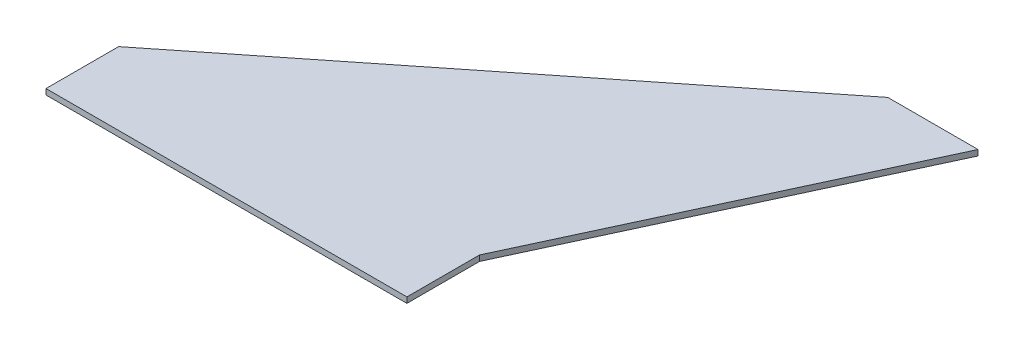
ISO-10303-21;
HEADER;
FILE_DESCRIPTION(('STEP AP214'),'2;1');
FILE_NAME('part.step','',(''),(''),'','','');
FILE_SCHEMA(('AUTOMOTIVE_DESIGN { 1 0 10303 214 1 1 1 1 }'));
ENDSEC;
DATA;
#1=APPLICATION_CONTEXT('core data for automotive mechanical design processes');
#2=APPLICATION_PROTOCOL_DEFINITION('international standard','automotive_design',2000,#1);
#3=PRODUCT_CONTEXT('',#1,'mechanical');
#4=PRODUCT('Part','Part','',(#3));
#5=PRODUCT_RELATED_PRODUCT_CATEGORY('part','',(#4));
#6=PRODUCT_DEFINITION_FORMATION('','',#4);
#7=PRODUCT_DEFINITION_CONTEXT('part definition',#1,'design');
#8=PRODUCT_DEFINITION('design','',#6,#7);
#9=PRODUCT_DEFINITION_SHAPE('','',#8);
#10=(LENGTH_UNIT() NAMED_UNIT(*) SI_UNIT(.MILLI.,.METRE.));
#11=(NAMED_UNIT(*) PLANE_ANGLE_UNIT() SI_UNIT($,.RADIAN.));
#12=(NAMED_UNIT(*) SI_UNIT($,.STERADIAN.) SOLID_ANGLE_UNIT());
#13=UNCERTAINTY_MEASURE_WITH_UNIT(LENGTH_MEASURE(1.E-05),#10,'distance_accuracy_value','');
#14=(GEOMETRIC_REPRESENTATION_CONTEXT(3) GLOBAL_UNCERTAINTY_ASSIGNED_CONTEXT((#13)) GLOBAL_UNIT_ASSIGNED_CONTEXT((#10,
#11,#12)) REPRESENTATION_CONTEXT('',''));
#15=CARTESIAN_POINT('',(0.,0.,0.));
#16=DIRECTION('',(0.,0.,1.));
#17=DIRECTION('',(1.,0.,0.));
#18=AXIS2_PLACEMENT_3D('',#15,#16,#17);
#19=CARTESIAN_POINT('',(203.2,3.175,0.));
#20=DIRECTION('',(-1.,0.,0.));
#21=DIRECTION('',(0.,0.,1.));
#22=AXIS2_PLACEMENT_3D('',#19,#20,#21);
#23=PLANE('',#22);
#24=DIRECTION('',(0.,0.,-1.));
#25=VECTOR('',#24,1.);
#26=CARTESIAN_POINT('',(203.2,0.,0.));
#27=LINE('',#26,#25);
#28=CARTESIAN_POINT('',(203.2,0.,0.));
#29=VERTEX_POINT('',#28);
#30=CARTESIAN_POINT('',(203.2,0.,-40.894));
#31=VERTEX_POINT('',#30);
#32=EDGE_CURVE('E120',#29,#31,#27,.T.);
#33=ORIENTED_EDGE('',*,*,#32,.T.);
#34=DIRECTION('',(0.,-1.,0.));
#35=VECTOR('',#34,1.);
#36=CARTESIAN_POINT('',(203.2,3.175,-40.894));
#37=LINE('',#36,#35);
#38=CARTESIAN_POINT('',(203.2,3.175,-40.894));
#39=VERTEX_POINT('',#38);
#40=EDGE_CURVE('E11',#39,#31,#37,.T.);
#41=ORIENTED_EDGE('',*,*,#40,.F.);
#42=DIRECTION('',(0.,0.,-1.));
#43=VECTOR('',#42,1.);
#44=CARTESIAN_POINT('',(203.2,3.175,0.));
#45=LINE('',#44,#43);
#46=CARTESIAN_POINT('',(203.2,3.175,0.));
#47=VERTEX_POINT('',#46);
#48=EDGE_CURVE('E85',#47,#39,#45,.T.);
#49=ORIENTED_EDGE('',*,*,#48,.F.);
#50=DIRECTION('',(0.,-1.,0.));
#51=VECTOR('',#50,1.);
#52=CARTESIAN_POINT('',(203.2,3.175,0.));
#53=LINE('',#52,#51);
#54=EDGE_CURVE('E116',#47,#29,#53,.T.);
#55=ORIENTED_EDGE('',*,*,#54,.T.);
#56=EDGE_LOOP('',(#33,#41,#49,#55));
#57=FACE_BOUND('',#56,.T.);
#58=ADVANCED_FACE('F39',(#57),#23,.F.);
#59=CARTESIAN_POINT('',(151.652056604455,3.175,70.3022778961048));
#60=DIRECTION('',(0.907254693579712,0.,0.42058164603033));
#61=DIRECTION('',(0.42058164603033,0.,-0.907254693579713));
#62=AXIS2_PLACEMENT_3D('',#59,#60,#61);
#63=PLANE('',#62);
#64=DIRECTION('',(-0.42058164603033,0.,0.907254693579713));
#65=VECTOR('',#64,1.);
#66=CARTESIAN_POINT('',(151.652056604455,0.,70.3022778961048));
#67=LINE('',#66,#65);
#68=CARTESIAN_POINT('',(292.1,0.,-232.664));
#69=VERTEX_POINT('',#68);
#70=EDGE_CURVE('E123',#69,#31,#67,.T.);
#71=ORIENTED_EDGE('',*,*,#70,.F.);
#72=DIRECTION('',(0.,-1.,0.));
#73=VECTOR('',#72,1.);
#74=CARTESIAN_POINT('',(292.1,3.175,-232.664));
#75=LINE('',#74,#73);
#76=CARTESIAN_POINT('',(292.1,3.175,-232.664));
#77=VERTEX_POINT('',#76);
#78=EDGE_CURVE('E47',#77,#69,#75,.T.);
#79=ORIENTED_EDGE('',*,*,#78,.F.);
#80=DIRECTION('',(-0.42058164603033,0.,0.907254693579713));
#81=VECTOR('',#80,1.);
#82=CARTESIAN_POINT('',(151.652056604455,3.175,70.3022778961048));
#83=LINE('',#82,#81);
#84=EDGE_CURVE('E145',#77,#39,#83,.T.);
#85=ORIENTED_EDGE('',*,*,#84,.T.);
#86=ORIENTED_EDGE('',*,*,#40,.T.);
#87=EDGE_LOOP('',(#71,#79,#85,#86));
#88=FACE_BOUND('',#87,.T.);
#89=ADVANCED_FACE('F144',(#88),#63,.T.);
#90=CARTESIAN_POINT('',(0.,3.175,-232.664));
#91=DIRECTION('',(0.,0.,1.));
#92=DIRECTION('',(1.,0.,0.));
#93=AXIS2_PLACEMENT_3D('',#90,#91,#92);
#94=PLANE('',#93);
#95=DIRECTION('',(-1.,0.,0.));
#96=VECTOR('',#95,1.);
#97=CARTESIAN_POINT('',(0.,0.,-232.664));
#98=LINE('',#97,#96);
#99=CARTESIAN_POINT('',(241.3,0.,-232.664));
#100=VERTEX_POINT('',#99);
#101=EDGE_CURVE('E126',#69,#100,#98,.T.);
#102=ORIENTED_EDGE('',*,*,#101,.T.);
#103=DIRECTION('',(0.,-1.,0.));
#104=VECTOR('',#103,1.);
#105=CARTESIAN_POINT('',(241.3,3.175,-232.664));
#106=LINE('',#105,#104);
#107=CARTESIAN_POINT('',(241.3,3.175,-232.664));
#108=VERTEX_POINT('',#107);
#109=EDGE_CURVE('E106',#108,#100,#106,.T.);
#110=ORIENTED_EDGE('',*,*,#109,.F.);
#111=DIRECTION('',(-1.,0.,0.));
#112=VECTOR('',#111,1.);
#113=CARTESIAN_POINT('',(0.,3.175,-232.664));
#114=LINE('',#113,#112);
#115=EDGE_CURVE('E111',#77,#108,#114,.T.);
#116=ORIENTED_EDGE('',*,*,#115,.F.);
#117=ORIENTED_EDGE('',*,*,#78,.T.);
#118=EDGE_LOOP('',(#102,#110,#116,#117));
#119=FACE_BOUND('',#118,.T.);
#120=ADVANCED_FACE('F137',(#119),#94,.F.);
#121=CARTESIAN_POINT('',(-19.9189973005552,3.175,-25.0636389874535));
#122=DIRECTION('',(-0.62217937915375,0.,-0.782874715491473));
#123=DIRECTION('',(-0.782874715491473,0.,0.62217937915375));
#124=AXIS2_PLACEMENT_3D('',#121,#122,#123);
#125=PLANE('',#124);
#126=DIRECTION('',(0.782874715491473,0.,-0.62217937915375));
#127=VECTOR('',#126,1.);
#128=CARTESIAN_POINT('',(-19.9189973005552,0.,-25.0636389874535));
#129=LINE('',#128,#127);
#130=CARTESIAN_POINT('',(0.,0.,-40.894));
#131=VERTEX_POINT('',#130);
#132=EDGE_CURVE('E101',#131,#100,#129,.T.);
#133=ORIENTED_EDGE('',*,*,#132,.F.);
#134=DIRECTION('',(0.,-1.,0.));
#135=VECTOR('',#134,1.);
#136=CARTESIAN_POINT('',(0.,3.175,-40.894));
#137=LINE('',#136,#135);
#138=CARTESIAN_POINT('',(0.,3.175,-40.894));
#139=VERTEX_POINT('',#138);
#140=EDGE_CURVE('E96',#139,#131,#137,.T.);
#141=ORIENTED_EDGE('',*,*,#140,.F.);
#142=DIRECTION('',(0.782874715491473,0.,-0.62217937915375));
#143=VECTOR('',#142,1.);
#144=CARTESIAN_POINT('',(-19.9189973005552,3.175,-25.0636389874535));
#145=LINE('',#144,#143);
#146=EDGE_CURVE('E99',#139,#108,#145,.T.);
#147=ORIENTED_EDGE('',*,*,#146,.T.);
#148=ORIENTED_EDGE('',*,*,#109,.T.);
#149=EDGE_LOOP('',(#133,#141,#147,#148));
#150=FACE_BOUND('',#149,.T.);
#151=ADVANCED_FACE('F98',(#150),#125,.T.);
#152=CARTESIAN_POINT('',(0.,3.175,0.));
#153=DIRECTION('',(-1.,0.,0.));
#154=DIRECTION('',(0.,0.,1.));
#155=AXIS2_PLACEMENT_3D('',#152,#153,#154);
#156=PLANE('',#155);
#157=DIRECTION('',(0.,0.,-1.));
#158=VECTOR('',#157,1.);
#159=CARTESIAN_POINT('',(0.,0.,0.));
#160=LINE('',#159,#158);
#161=CARTESIAN_POINT('',(0.,0.,0.));
#162=VERTEX_POINT('',#161);
#163=EDGE_CURVE('E130',#162,#131,#160,.T.);
#164=ORIENTED_EDGE('',*,*,#163,.F.);
#165=DIRECTION('',(0.,-1.,0.));
#166=VECTOR('',#165,1.);
#167=CARTESIAN_POINT('',(0.,3.175,0.));
#168=LINE('',#167,#166);
#169=CARTESIAN_POINT('',(0.,3.175,0.));
#170=VERTEX_POINT('',#169);
#171=EDGE_CURVE('E76',#170,#162,#168,.T.);
#172=ORIENTED_EDGE('',*,*,#171,.F.);
#173=DIRECTION('',(0.,0.,-1.));
#174=VECTOR('',#173,1.);
#175=CARTESIAN_POINT('',(0.,3.175,0.));
#176=LINE('',#175,#174);
#177=EDGE_CURVE('E109',#170,#139,#176,.T.);
#178=ORIENTED_EDGE('',*,*,#177,.T.);
#179=ORIENTED_EDGE('',*,*,#140,.T.);
#180=EDGE_LOOP('',(#164,#172,#178,#179));
#181=FACE_BOUND('',#180,.T.);
#182=ADVANCED_FACE('F114',(#181),#156,.T.);
#183=CARTESIAN_POINT('',(0.,3.175,0.));
#184=DIRECTION('',(0.,0.,-1.));
#185=DIRECTION('',(-1.,0.,0.));
#186=AXIS2_PLACEMENT_3D('',#183,#184,#185);
#187=PLANE('',#186);
#188=DIRECTION('',(1.,0.,0.));
#189=VECTOR('',#188,1.);
#190=CARTESIAN_POINT('',(0.,0.,0.));
#191=LINE('',#190,#189);
#192=EDGE_CURVE('E79',#162,#29,#191,.T.);
#193=ORIENTED_EDGE('',*,*,#192,.T.);
#194=ORIENTED_EDGE('',*,*,#54,.F.);
#195=DIRECTION('',(1.,0.,0.));
#196=VECTOR('',#195,1.);
#197=CARTESIAN_POINT('',(0.,3.175,0.));
#198=LINE('',#197,#196);
#199=EDGE_CURVE('E55',#170,#47,#198,.T.);
#200=ORIENTED_EDGE('',*,*,#199,.F.);
#201=ORIENTED_EDGE('',*,*,#171,.T.);
#202=EDGE_LOOP('',(#193,#194,#200,#201));
#203=FACE_BOUND('',#202,.T.);
#204=ADVANCED_FACE('F147',(#203),#187,.F.);
#205=CARTESIAN_POINT('',(0.,3.175,0.));
#206=DIRECTION('',(0.,1.,0.));
#207=DIRECTION('',(0.,0.,1.));
#208=AXIS2_PLACEMENT_3D('',#205,#206,#207);
#209=PLANE('',#208);
#210=ORIENTED_EDGE('',*,*,#48,.T.);
#211=ORIENTED_EDGE('',*,*,#84,.F.);
#212=ORIENTED_EDGE('',*,*,#115,.T.);
#213=ORIENTED_EDGE('',*,*,#146,.F.);
#214=ORIENTED_EDGE('',*,*,#177,.F.);
#215=ORIENTED_EDGE('',*,*,#199,.T.);
#216=EDGE_LOOP('',(#210,#211,#212,#213,#214,#215));
#217=FACE_BOUND('',#216,.T.);
#218=ADVANCED_FACE('F108',(#217),#209,.T.);
#219=CARTESIAN_POINT('',(0.,0.,0.));
#220=DIRECTION('',(0.,1.,0.));
#221=DIRECTION('',(0.,0.,1.));
#222=AXIS2_PLACEMENT_3D('',#219,#220,#221);
#223=PLANE('',#222);
#224=ORIENTED_EDGE('',*,*,#32,.F.);
#225=ORIENTED_EDGE('',*,*,#192,.F.);
#226=ORIENTED_EDGE('',*,*,#163,.T.);
#227=ORIENTED_EDGE('',*,*,#132,.T.);
#228=ORIENTED_EDGE('',*,*,#101,.F.);
#229=ORIENTED_EDGE('',*,*,#70,.T.);
#230=EDGE_LOOP('',(#224,#225,#226,#227,#228,#229));
#231=FACE_BOUND('',#230,.T.);
#232=ADVANCED_FACE('F143',(#231),#223,.F.);
#233=CLOSED_SHELL('',(#58,#89,#120,#151,#182,#204,#218,#232));
#234=MANIFOLD_SOLID_BREP('B2',#233);
#235=ADVANCED_BREP_SHAPE_REPRESENTATION('',(#18,#234),#14);
#236=SHAPE_DEFINITION_REPRESENTATION(#9,#235);
ENDSEC;
END-ISO-10303-21;
